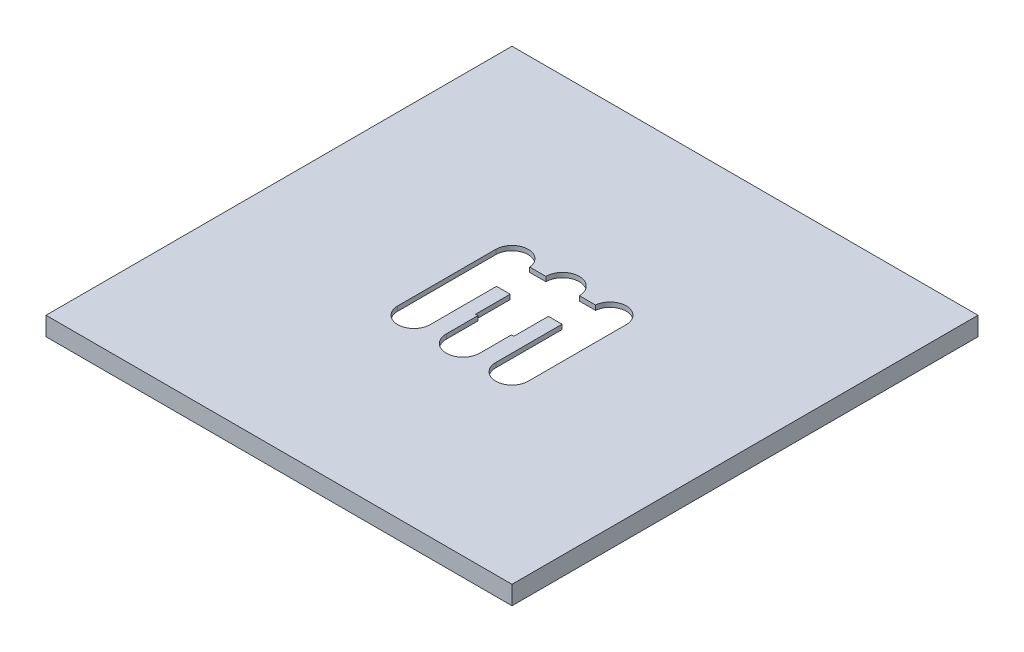
ISO-10303-21;
HEADER;
FILE_DESCRIPTION(('STEP AP214'),'2;1');
FILE_NAME('part.step','',(''),(''),'','','');
FILE_SCHEMA(('AUTOMOTIVE_DESIGN { 1 0 10303 214 1 1 1 1 }'));
ENDSEC;
DATA;
#1=APPLICATION_CONTEXT('core data for automotive mechanical design processes');
#2=APPLICATION_PROTOCOL_DEFINITION('international standard','automotive_design',2000,#1);
#3=PRODUCT_CONTEXT('',#1,'mechanical');
#4=PRODUCT('Part','Part','',(#3));
#5=PRODUCT_RELATED_PRODUCT_CATEGORY('part','',(#4));
#6=PRODUCT_DEFINITION_FORMATION('','',#4);
#7=PRODUCT_DEFINITION_CONTEXT('part definition',#1,'design');
#8=PRODUCT_DEFINITION('design','',#6,#7);
#9=PRODUCT_DEFINITION_SHAPE('','',#8);
#10=(LENGTH_UNIT() NAMED_UNIT(*) SI_UNIT(.MILLI.,.METRE.));
#11=(NAMED_UNIT(*) PLANE_ANGLE_UNIT() SI_UNIT($,.RADIAN.));
#12=(NAMED_UNIT(*) SI_UNIT($,.STERADIAN.) SOLID_ANGLE_UNIT());
#13=UNCERTAINTY_MEASURE_WITH_UNIT(LENGTH_MEASURE(1.E-05),#10,'distance_accuracy_value','');
#14=(GEOMETRIC_REPRESENTATION_CONTEXT(3) GLOBAL_UNCERTAINTY_ASSIGNED_CONTEXT((#13)) GLOBAL_UNIT_ASSIGNED_CONTEXT((#10,
#11,#12)) REPRESENTATION_CONTEXT('',''));
#15=CARTESIAN_POINT('',(0.,0.,0.));
#16=DIRECTION('',(0.,0.,1.));
#17=DIRECTION('',(1.,0.,0.));
#18=AXIS2_PLACEMENT_3D('',#15,#16,#17);
#19=CARTESIAN_POINT('',(0.,4.,0.));
#20=DIRECTION('',(0.,1.,0.));
#21=DIRECTION('',(0.,0.,1.));
#22=AXIS2_PLACEMENT_3D('',#19,#20,#21);
#23=PLANE('',#22);
#24=DIRECTION('',(0.,0.,1.));
#25=VECTOR('',#24,1.);
#26=CARTESIAN_POINT('',(-50.,4.,-50.));
#27=LINE('',#26,#25);
#28=CARTESIAN_POINT('',(-50.,4.,-50.));
#29=VERTEX_POINT('',#28);
#30=CARTESIAN_POINT('',(-50.,4.,50.));
#31=VERTEX_POINT('',#30);
#32=EDGE_CURVE('E394',#29,#31,#27,.T.);
#33=ORIENTED_EDGE('',*,*,#32,.T.);
#34=DIRECTION('',(1.,0.,0.));
#35=VECTOR('',#34,1.);
#36=CARTESIAN_POINT('',(-50.,4.,50.));
#37=LINE('',#36,#35);
#38=CARTESIAN_POINT('',(50.,4.,50.));
#39=VERTEX_POINT('',#38);
#40=EDGE_CURVE('E451',#31,#39,#37,.T.);
#41=ORIENTED_EDGE('',*,*,#40,.T.);
#42=DIRECTION('',(0.,0.,-1.));
#43=VECTOR('',#42,1.);
#44=CARTESIAN_POINT('',(50.,4.,50.));
#45=LINE('',#44,#43);
#46=CARTESIAN_POINT('',(50.,4.,-50.));
#47=VERTEX_POINT('',#46);
#48=EDGE_CURVE('E455',#39,#47,#45,.T.);
#49=ORIENTED_EDGE('',*,*,#48,.T.);
#50=DIRECTION('',(-1.,0.,0.));
#51=VECTOR('',#50,1.);
#52=CARTESIAN_POINT('',(50.,4.,-50.));
#53=LINE('',#52,#51);
#54=EDGE_CURVE('E459',#47,#29,#53,.T.);
#55=ORIENTED_EDGE('',*,*,#54,.T.);
#56=EDGE_LOOP('',(#33,#41,#49,#55));
#57=FACE_BOUND('',#56,.T.);
#58=DIRECTION('',(0.,0.,-1.));
#59=VECTOR('',#58,1.);
#60=CARTESIAN_POINT('',(-4.10477687296407,4.,0.));
#61=LINE('',#60,#59);
#62=CARTESIAN_POINT('',(-4.10477687296407,4.,3.70910488253883));
#63=VERTEX_POINT('',#62);
#64=CARTESIAN_POINT('',(-4.10477687296407,4.,-3.70910488253884));
#65=VERTEX_POINT('',#64);
#66=EDGE_CURVE('E247',#63,#65,#61,.T.);
#67=ORIENTED_EDGE('',*,*,#66,.T.);
#68=DIRECTION('',(1.,0.,0.));
#69=VECTOR('',#68,1.);
#70=CARTESIAN_POINT('',(0.,4.,-3.70910488253884));
#71=LINE('',#70,#69);
#72=CARTESIAN_POINT('',(-7.03476982904009,4.,-3.70910488253884));
#73=VERTEX_POINT('',#72);
#74=EDGE_CURVE('E238',#73,#65,#71,.T.);
#75=ORIENTED_EDGE('',*,*,#74,.F.);
#76=DIRECTION('',(0.,0.,-1.));
#77=VECTOR('',#76,1.);
#78=CARTESIAN_POINT('',(-7.0347698290401,4.,0.));
#79=LINE('',#78,#77);
#80=CARTESIAN_POINT('',(-7.0347698290401,4.,10.5173849145201));
#81=VERTEX_POINT('',#80);
#82=EDGE_CURVE('E228',#81,#73,#79,.T.);
#83=ORIENTED_EDGE('',*,*,#82,.F.);
#84=CARTESIAN_POINT('',(-10.5173849145201,4.,10.5173849145201));
#85=DIRECTION('',(0.,-1.,0.));
#86=DIRECTION('',(0.,0.,-1.));
#87=AXIS2_PLACEMENT_3D('',#84,#85,#86);
#88=CIRCLE('',#87,3.48261508547995);
#89=CARTESIAN_POINT('',(-14.,4.,10.5173849145201));
#90=VERTEX_POINT('',#89);
#91=EDGE_CURVE('E67',#81,#90,#88,.T.);
#92=ORIENTED_EDGE('',*,*,#91,.T.);
#93=DIRECTION('',(0.,0.,-1.));
#94=VECTOR('',#93,1.);
#95=CARTESIAN_POINT('',(-14.,4.,0.));
#96=LINE('',#95,#94);
#97=CARTESIAN_POINT('',(-14.,4.,-10.51738491452));
#98=VERTEX_POINT('',#97);
#99=EDGE_CURVE('E261',#90,#98,#96,.T.);
#100=ORIENTED_EDGE('',*,*,#99,.T.);
#101=CARTESIAN_POINT('',(-10.51738491452,4.,-10.51738491452));
#102=DIRECTION('',(0.,-1.,0.));
#103=DIRECTION('',(0.,0.,-1.));
#104=AXIS2_PLACEMENT_3D('',#101,#102,#103);
#105=CIRCLE('',#104,3.48261508547995);
#106=CARTESIAN_POINT('',(-7.05140271388099,4.,-10.8573484691341));
#107=VERTEX_POINT('',#106);
#108=EDGE_CURVE('E265',#98,#107,#105,.T.);
#109=ORIENTED_EDGE('',*,*,#108,.T.);
#110=DIRECTION('',(1.,0.,0.));
#111=VECTOR('',#110,1.);
#112=CARTESIAN_POINT('',(0.,4.,-10.8573484691341));
#113=LINE('',#112,#111);
#114=CARTESIAN_POINT('',(-3.5915745067874,4.,-10.8573484691341));
#115=VERTEX_POINT('',#114);
#116=EDGE_CURVE('E269',#107,#115,#113,.T.);
#117=ORIENTED_EDGE('',*,*,#116,.T.);
#118=CARTESIAN_POINT('',(0.,4.,-10.8573484691341));
#119=DIRECTION('',(0.,-1.,0.));
#120=DIRECTION('',(0.,0.,-1.));
#121=AXIS2_PLACEMENT_3D('',#118,#119,#120);
#122=CIRCLE('',#121,3.5915745067874);
#123=CARTESIAN_POINT('',(3.5915745067874,4.,-10.8573484691341));
#124=VERTEX_POINT('',#123);
#125=EDGE_CURVE('E273',#115,#124,#122,.T.);
#126=ORIENTED_EDGE('',*,*,#125,.T.);
#127=DIRECTION('',(1.,0.,0.));
#128=VECTOR('',#127,1.);
#129=CARTESIAN_POINT('',(0.,4.,-10.8573484691341));
#130=LINE('',#129,#128);
#131=CARTESIAN_POINT('',(7.05140271388099,4.,-10.8573484691341));
#132=VERTEX_POINT('',#131);
#133=EDGE_CURVE('E277',#124,#132,#130,.T.);
#134=ORIENTED_EDGE('',*,*,#133,.T.);
#135=CARTESIAN_POINT('',(10.51738491452,4.,-10.51738491452));
#136=DIRECTION('',(0.,-1.,0.));
#137=DIRECTION('',(0.,0.,-1.));
#138=AXIS2_PLACEMENT_3D('',#135,#136,#137);
#139=CIRCLE('',#138,3.48261508547995);
#140=CARTESIAN_POINT('',(14.,4.,-10.51738491452));
#141=VERTEX_POINT('',#140);
#142=EDGE_CURVE('E281',#141,#132,#139,.F.);
#143=ORIENTED_EDGE('',*,*,#142,.F.);
#144=DIRECTION('',(0.,0.,-1.));
#145=VECTOR('',#144,1.);
#146=CARTESIAN_POINT('',(14.,4.,0.));
#147=LINE('',#146,#145);
#148=CARTESIAN_POINT('',(14.,4.,10.5173849145201));
#149=VERTEX_POINT('',#148);
#150=EDGE_CURVE('E284',#149,#141,#147,.T.);
#151=ORIENTED_EDGE('',*,*,#150,.F.);
#152=CARTESIAN_POINT('',(10.5173849145201,4.,10.5173849145201));
#153=DIRECTION('',(0.,-1.,0.));
#154=DIRECTION('',(0.,0.,-1.));
#155=AXIS2_PLACEMENT_3D('',#152,#153,#154);
#156=CIRCLE('',#155,3.48261508547995);
#157=CARTESIAN_POINT('',(7.0347698290401,4.,10.5173849145201));
#158=VERTEX_POINT('',#157);
#159=EDGE_CURVE('E287',#158,#149,#156,.F.);
#160=ORIENTED_EDGE('',*,*,#159,.F.);
#161=DIRECTION('',(0.,0.,-1.));
#162=VECTOR('',#161,1.);
#163=CARTESIAN_POINT('',(7.0347698290401,4.,0.));
#164=LINE('',#163,#162);
#165=CARTESIAN_POINT('',(7.03476982904009,4.,-3.70910488253884));
#166=VERTEX_POINT('',#165);
#167=EDGE_CURVE('E290',#158,#166,#164,.T.);
#168=ORIENTED_EDGE('',*,*,#167,.T.);
#169=DIRECTION('',(1.,0.,0.));
#170=VECTOR('',#169,1.);
#171=CARTESIAN_POINT('',(0.,4.,-3.70910488253884));
#172=LINE('',#171,#170);
#173=CARTESIAN_POINT('',(4.10477687296407,4.,-3.70910488253884));
#174=VERTEX_POINT('',#173);
#175=EDGE_CURVE('E294',#174,#166,#172,.T.);
#176=ORIENTED_EDGE('',*,*,#175,.F.);
#177=DIRECTION('',(0.,0.,-1.));
#178=VECTOR('',#177,1.);
#179=CARTESIAN_POINT('',(4.10477687296407,4.,0.));
#180=LINE('',#179,#178);
#181=CARTESIAN_POINT('',(4.10477687296407,4.,3.70910488253883));
#182=VERTEX_POINT('',#181);
#183=EDGE_CURVE('E297',#182,#174,#180,.T.);
#184=ORIENTED_EDGE('',*,*,#183,.F.);
#185=DIRECTION('',(-1.,0.,0.));
#186=VECTOR('',#185,1.);
#187=CARTESIAN_POINT('',(0.,4.,3.70910488253883));
#188=LINE('',#187,#186);
#189=CARTESIAN_POINT('',(3.5915745067874,4.,3.70910488253883));
#190=VERTEX_POINT('',#189);
#191=EDGE_CURVE('E300',#182,#190,#188,.T.);
#192=ORIENTED_EDGE('',*,*,#191,.T.);
#193=DIRECTION('',(0.,0.,-1.));
#194=VECTOR('',#193,1.);
#195=CARTESIAN_POINT('',(3.5915745067874,4.,0.));
#196=LINE('',#195,#194);
#197=CARTESIAN_POINT('',(3.5915745067874,4.,10.51738491452));
#198=VERTEX_POINT('',#197);
#199=EDGE_CURVE('E304',#198,#190,#196,.T.);
#200=ORIENTED_EDGE('',*,*,#199,.F.);
#201=CARTESIAN_POINT('',(0.,4.,10.51738491452));
#202=DIRECTION('',(0.,-1.,0.));
#203=DIRECTION('',(0.,0.,-1.));
#204=AXIS2_PLACEMENT_3D('',#201,#202,#203);
#205=CIRCLE('',#204,3.5915745067874);
#206=CARTESIAN_POINT('',(-3.5915745067874,4.,10.51738491452));
#207=VERTEX_POINT('',#206);
#208=EDGE_CURVE('E307',#198,#207,#205,.T.);
#209=ORIENTED_EDGE('',*,*,#208,.T.);
#210=DIRECTION('',(0.,0.,-1.));
#211=VECTOR('',#210,1.);
#212=CARTESIAN_POINT('',(-3.5915745067874,4.,0.));
#213=LINE('',#212,#211);
#214=CARTESIAN_POINT('',(-3.5915745067874,4.,3.70910488253883));
#215=VERTEX_POINT('',#214);
#216=EDGE_CURVE('E311',#207,#215,#213,.T.);
#217=ORIENTED_EDGE('',*,*,#216,.T.);
#218=DIRECTION('',(-1.,0.,0.));
#219=VECTOR('',#218,1.);
#220=CARTESIAN_POINT('',(0.,4.,3.70910488253883));
#221=LINE('',#220,#219);
#222=EDGE_CURVE('E315',#215,#63,#221,.T.);
#223=ORIENTED_EDGE('',*,*,#222,.T.);
#224=EDGE_LOOP('',(#67,#75,#83,#92,#100,#109,#117,#126,#134,#143,#151,#160,#168,#176,#184,#192,
#200,#209,#217,#223));
#225=FACE_BOUND('',#224,.T.);
#226=ADVANCED_FACE('F43',(#57,#225),#23,.T.);
#227=CARTESIAN_POINT('',(0.,0.,0.));
#228=DIRECTION('',(0.,-1.,0.));
#229=DIRECTION('',(0.,0.,-1.));
#230=AXIS2_PLACEMENT_3D('',#227,#228,#229);
#231=PLANE('',#230);
#232=DIRECTION('',(0.,0.,1.));
#233=VECTOR('',#232,1.);
#234=CARTESIAN_POINT('',(-50.,0.,-50.));
#235=LINE('',#234,#233);
#236=CARTESIAN_POINT('',(-50.,0.,-50.));
#237=VERTEX_POINT('',#236);
#238=CARTESIAN_POINT('',(-50.,0.,50.));
#239=VERTEX_POINT('',#238);
#240=EDGE_CURVE('E509',#237,#239,#235,.T.);
#241=ORIENTED_EDGE('',*,*,#240,.F.);
#242=DIRECTION('',(-1.,0.,0.));
#243=VECTOR('',#242,1.);
#244=CARTESIAN_POINT('',(50.,0.,-50.));
#245=LINE('',#244,#243);
#246=CARTESIAN_POINT('',(50.,0.,-50.));
#247=VERTEX_POINT('',#246);
#248=EDGE_CURVE('E519',#247,#237,#245,.T.);
#249=ORIENTED_EDGE('',*,*,#248,.F.);
#250=DIRECTION('',(0.,0.,-1.));
#251=VECTOR('',#250,1.);
#252=CARTESIAN_POINT('',(50.,0.,-50.));
#253=LINE('',#252,#251);
#254=CARTESIAN_POINT('',(50.,0.,50.));
#255=VERTEX_POINT('',#254);
#256=EDGE_CURVE('E516',#255,#247,#253,.T.);
#257=ORIENTED_EDGE('',*,*,#256,.F.);
#258=DIRECTION('',(1.,0.,0.));
#259=VECTOR('',#258,1.);
#260=CARTESIAN_POINT('',(50.,0.,50.));
#261=LINE('',#260,#259);
#262=EDGE_CURVE('E513',#239,#255,#261,.T.);
#263=ORIENTED_EDGE('',*,*,#262,.F.);
#264=EDGE_LOOP('',(#241,#249,#257,#263));
#265=FACE_BOUND('',#264,.T.);
#266=DIRECTION('',(0.,0.,-1.));
#267=VECTOR('',#266,1.);
#268=CARTESIAN_POINT('',(48.,0.,-48.));
#269=LINE('',#268,#267);
#270=CARTESIAN_POINT('',(48.,0.,48.));
#271=VERTEX_POINT('',#270);
#272=CARTESIAN_POINT('',(48.,0.,-48.));
#273=VERTEX_POINT('',#272);
#274=EDGE_CURVE('E469',#271,#273,#269,.T.);
#275=ORIENTED_EDGE('',*,*,#274,.T.);
#276=DIRECTION('',(-1.,0.,0.));
#277=VECTOR('',#276,1.);
#278=CARTESIAN_POINT('',(48.,0.,-48.));
#279=LINE('',#278,#277);
#280=CARTESIAN_POINT('',(-48.,0.,-48.));
#281=VERTEX_POINT('',#280);
#282=EDGE_CURVE('E463',#273,#281,#279,.T.);
#283=ORIENTED_EDGE('',*,*,#282,.T.);
#284=DIRECTION('',(0.,0.,1.));
#285=VECTOR('',#284,1.);
#286=CARTESIAN_POINT('',(-48.,0.,-48.));
#287=LINE('',#286,#285);
#288=CARTESIAN_POINT('',(-48.,0.,48.));
#289=VERTEX_POINT('',#288);
#290=EDGE_CURVE('E485',#281,#289,#287,.T.);
#291=ORIENTED_EDGE('',*,*,#290,.T.);
#292=DIRECTION('',(1.,0.,0.));
#293=VECTOR('',#292,1.);
#294=CARTESIAN_POINT('',(48.,0.,48.));
#295=LINE('',#294,#293);
#296=EDGE_CURVE('E489',#289,#271,#295,.T.);
#297=ORIENTED_EDGE('',*,*,#296,.T.);
#298=EDGE_LOOP('',(#275,#283,#291,#297));
#299=FACE_BOUND('',#298,.T.);
#300=ADVANCED_FACE('F540',(#265,#299),#231,.T.);
#301=CARTESIAN_POINT('',(-50.,3.,-50.));
#302=DIRECTION('',(1.,0.,0.));
#303=DIRECTION('',(0.,0.,-1.));
#304=AXIS2_PLACEMENT_3D('',#301,#302,#303);
#305=PLANE('',#304);
#306=ORIENTED_EDGE('',*,*,#240,.T.);
#307=DIRECTION('',(0.,-1.,0.));
#308=VECTOR('',#307,1.);
#309=CARTESIAN_POINT('',(-50.,3.,50.));
#310=LINE('',#309,#308);
#311=EDGE_CURVE('E11',#31,#239,#310,.T.);
#312=ORIENTED_EDGE('',*,*,#311,.F.);
#313=ORIENTED_EDGE('',*,*,#32,.F.);
#314=DIRECTION('',(0.,-1.,0.));
#315=VECTOR('',#314,1.);
#316=CARTESIAN_POINT('',(-50.,3.,-50.));
#317=LINE('',#316,#315);
#318=EDGE_CURVE('E522',#29,#237,#317,.T.);
#319=ORIENTED_EDGE('',*,*,#318,.T.);
#320=EDGE_LOOP('',(#306,#312,#313,#319));
#321=FACE_BOUND('',#320,.T.);
#322=ADVANCED_FACE('F45',(#321),#305,.F.);
#323=CARTESIAN_POINT('',(50.,3.,50.));
#324=DIRECTION('',(0.,0.,-1.));
#325=DIRECTION('',(-1.,0.,0.));
#326=AXIS2_PLACEMENT_3D('',#323,#324,#325);
#327=PLANE('',#326);
#328=ORIENTED_EDGE('',*,*,#262,.T.);
#329=DIRECTION('',(0.,-1.,0.));
#330=VECTOR('',#329,1.);
#331=CARTESIAN_POINT('',(50.,3.,50.));
#332=LINE('',#331,#330);
#333=EDGE_CURVE('E52',#39,#255,#332,.T.);
#334=ORIENTED_EDGE('',*,*,#333,.F.);
#335=ORIENTED_EDGE('',*,*,#40,.F.);
#336=ORIENTED_EDGE('',*,*,#311,.T.);
#337=EDGE_LOOP('',(#328,#334,#335,#336));
#338=FACE_BOUND('',#337,.T.);
#339=ADVANCED_FACE('F548',(#338),#327,.F.);
#340=CARTESIAN_POINT('',(50.,3.,-50.));
#341=DIRECTION('',(-1.,0.,0.));
#342=DIRECTION('',(0.,0.,1.));
#343=AXIS2_PLACEMENT_3D('',#340,#341,#342);
#344=PLANE('',#343);
#345=ORIENTED_EDGE('',*,*,#256,.T.);
#346=DIRECTION('',(0.,-1.,0.));
#347=VECTOR('',#346,1.);
#348=CARTESIAN_POINT('',(50.,3.,-50.));
#349=LINE('',#348,#347);
#350=EDGE_CURVE('E526',#47,#247,#349,.T.);
#351=ORIENTED_EDGE('',*,*,#350,.F.);
#352=ORIENTED_EDGE('',*,*,#48,.F.);
#353=ORIENTED_EDGE('',*,*,#333,.T.);
#354=EDGE_LOOP('',(#345,#351,#352,#353));
#355=FACE_BOUND('',#354,.T.);
#356=ADVANCED_FACE('F534',(#355),#344,.F.);
#357=CARTESIAN_POINT('',(50.,3.,-50.));
#358=DIRECTION('',(0.,0.,1.));
#359=DIRECTION('',(1.,0.,0.));
#360=AXIS2_PLACEMENT_3D('',#357,#358,#359);
#361=PLANE('',#360);
#362=ORIENTED_EDGE('',*,*,#248,.T.);
#363=ORIENTED_EDGE('',*,*,#318,.F.);
#364=ORIENTED_EDGE('',*,*,#54,.F.);
#365=ORIENTED_EDGE('',*,*,#350,.T.);
#366=EDGE_LOOP('',(#362,#363,#364,#365));
#367=FACE_BOUND('',#366,.T.);
#368=ADVANCED_FACE('F543',(#367),#361,.F.);
#369=CARTESIAN_POINT('',(48.,3.,-48.));
#370=DIRECTION('',(0.,0.,1.));
#371=DIRECTION('',(1.,0.,0.));
#372=AXIS2_PLACEMENT_3D('',#369,#370,#371);
#373=PLANE('',#372);
#374=ORIENTED_EDGE('',*,*,#282,.F.);
#375=DIRECTION('',(0.,-1.,0.));
#376=VECTOR('',#375,1.);
#377=CARTESIAN_POINT('',(48.,3.,-48.));
#378=LINE('',#377,#376);
#379=CARTESIAN_POINT('',(48.,3.,-48.));
#380=VERTEX_POINT('',#379);
#381=EDGE_CURVE('E481',#380,#273,#378,.T.);
#382=ORIENTED_EDGE('',*,*,#381,.F.);
#383=DIRECTION('',(-1.,0.,0.));
#384=VECTOR('',#383,1.);
#385=CARTESIAN_POINT('',(48.,3.,-48.));
#386=LINE('',#385,#384);
#387=CARTESIAN_POINT('',(-48.,3.,-48.));
#388=VERTEX_POINT('',#387);
#389=EDGE_CURVE('E464',#380,#388,#386,.T.);
#390=ORIENTED_EDGE('',*,*,#389,.T.);
#391=DIRECTION('',(0.,-1.,0.));
#392=VECTOR('',#391,1.);
#393=CARTESIAN_POINT('',(-48.,3.,-48.));
#394=LINE('',#393,#392);
#395=EDGE_CURVE('E505',#388,#281,#394,.T.);
#396=ORIENTED_EDGE('',*,*,#395,.T.);
#397=EDGE_LOOP('',(#374,#382,#390,#396));
#398=FACE_BOUND('',#397,.T.);
#399=ADVANCED_FACE('F579',(#398),#373,.T.);
#400=CARTESIAN_POINT('',(-48.,3.,-48.));
#401=DIRECTION('',(1.,0.,0.));
#402=DIRECTION('',(0.,0.,-1.));
#403=AXIS2_PLACEMENT_3D('',#400,#401,#402);
#404=PLANE('',#403);
#405=ORIENTED_EDGE('',*,*,#290,.F.);
#406=ORIENTED_EDGE('',*,*,#395,.F.);
#407=DIRECTION('',(0.,0.,1.));
#408=VECTOR('',#407,1.);
#409=CARTESIAN_POINT('',(-48.,3.,-48.));
#410=LINE('',#409,#408);
#411=CARTESIAN_POINT('',(-48.,3.,48.));
#412=VERTEX_POINT('',#411);
#413=EDGE_CURVE('E468',#388,#412,#410,.T.);
#414=ORIENTED_EDGE('',*,*,#413,.T.);
#415=DIRECTION('',(0.,-1.,0.));
#416=VECTOR('',#415,1.);
#417=CARTESIAN_POINT('',(-48.,3.,48.));
#418=LINE('',#417,#416);
#419=EDGE_CURVE('E502',#412,#289,#418,.T.);
#420=ORIENTED_EDGE('',*,*,#419,.T.);
#421=EDGE_LOOP('',(#405,#406,#414,#420));
#422=FACE_BOUND('',#421,.T.);
#423=ADVANCED_FACE('F575',(#422),#404,.T.);
#424=CARTESIAN_POINT('',(48.,3.,48.));
#425=DIRECTION('',(0.,0.,-1.));
#426=DIRECTION('',(-1.,0.,0.));
#427=AXIS2_PLACEMENT_3D('',#424,#425,#426);
#428=PLANE('',#427);
#429=ORIENTED_EDGE('',*,*,#296,.F.);
#430=ORIENTED_EDGE('',*,*,#419,.F.);
#431=DIRECTION('',(1.,0.,0.));
#432=VECTOR('',#431,1.);
#433=CARTESIAN_POINT('',(48.,3.,48.));
#434=LINE('',#433,#432);
#435=CARTESIAN_POINT('',(48.,3.,48.));
#436=VERTEX_POINT('',#435);
#437=EDGE_CURVE('E473',#412,#436,#434,.T.);
#438=ORIENTED_EDGE('',*,*,#437,.T.);
#439=DIRECTION('',(0.,-1.,0.));
#440=VECTOR('',#439,1.);
#441=CARTESIAN_POINT('',(48.,3.,48.));
#442=LINE('',#441,#440);
#443=EDGE_CURVE('E499',#436,#271,#442,.T.);
#444=ORIENTED_EDGE('',*,*,#443,.T.);
#445=EDGE_LOOP('',(#429,#430,#438,#444));
#446=FACE_BOUND('',#445,.T.);
#447=ADVANCED_FACE('F571',(#446),#428,.T.);
#448=CARTESIAN_POINT('',(48.,3.,-48.));
#449=DIRECTION('',(-1.,0.,0.));
#450=DIRECTION('',(0.,0.,1.));
#451=AXIS2_PLACEMENT_3D('',#448,#449,#450);
#452=PLANE('',#451);
#453=ORIENTED_EDGE('',*,*,#274,.F.);
#454=ORIENTED_EDGE('',*,*,#443,.F.);
#455=DIRECTION('',(0.,0.,-1.));
#456=VECTOR('',#455,1.);
#457=CARTESIAN_POINT('',(48.,3.,-48.));
#458=LINE('',#457,#456);
#459=EDGE_CURVE('E477',#436,#380,#458,.T.);
#460=ORIENTED_EDGE('',*,*,#459,.T.);
#461=ORIENTED_EDGE('',*,*,#381,.T.);
#462=EDGE_LOOP('',(#453,#454,#460,#461));
#463=FACE_BOUND('',#462,.T.);
#464=ADVANCED_FACE('F567',(#463),#452,.T.);
#465=CARTESIAN_POINT('',(0.,3.,0.));
#466=DIRECTION('',(0.,1.,0.));
#467=DIRECTION('',(0.,0.,1.));
#468=AXIS2_PLACEMENT_3D('',#465,#466,#467);
#469=PLANE('',#468);
#470=DIRECTION('',(0.,0.,-1.));
#471=VECTOR('',#470,1.);
#472=CARTESIAN_POINT('',(-7.0347698290401,3.,0.));
#473=LINE('',#472,#471);
#474=CARTESIAN_POINT('',(-7.0347698290401,3.,10.5173849145201));
#475=VERTEX_POINT('',#474);
#476=CARTESIAN_POINT('',(-7.03476982904009,3.,-3.70910488253884));
#477=VERTEX_POINT('',#476);
#478=EDGE_CURVE('E322',#475,#477,#473,.T.);
#479=ORIENTED_EDGE('',*,*,#478,.T.);
#480=DIRECTION('',(1.,0.,0.));
#481=VECTOR('',#480,1.);
#482=CARTESIAN_POINT('',(0.,3.,-3.70910488253884));
#483=LINE('',#482,#481);
#484=CARTESIAN_POINT('',(-4.10477687296407,3.,-3.70910488253884));
#485=VERTEX_POINT('',#484);
#486=EDGE_CURVE('E244',#477,#485,#483,.T.);
#487=ORIENTED_EDGE('',*,*,#486,.T.);
#488=DIRECTION('',(0.,0.,-1.));
#489=VECTOR('',#488,1.);
#490=CARTESIAN_POINT('',(-4.10477687296407,3.,0.));
#491=LINE('',#490,#489);
#492=CARTESIAN_POINT('',(-4.10477687296407,3.,3.70910488253883));
#493=VERTEX_POINT('',#492);
#494=EDGE_CURVE('E253',#493,#485,#491,.T.);
#495=ORIENTED_EDGE('',*,*,#494,.F.);
#496=DIRECTION('',(-1.,0.,0.));
#497=VECTOR('',#496,1.);
#498=CARTESIAN_POINT('',(0.,3.,3.70910488253883));
#499=LINE('',#498,#497);
#500=CARTESIAN_POINT('',(-3.5915745067874,3.,3.70910488253883));
#501=VERTEX_POINT('',#500);
#502=EDGE_CURVE('E59',#501,#493,#499,.T.);
#503=ORIENTED_EDGE('',*,*,#502,.F.);
#504=DIRECTION('',(0.,0.,-1.));
#505=VECTOR('',#504,1.);
#506=CARTESIAN_POINT('',(-3.5915745067874,3.,0.));
#507=LINE('',#506,#505);
#508=CARTESIAN_POINT('',(-3.5915745067874,3.,10.51738491452));
#509=VERTEX_POINT('',#508);
#510=EDGE_CURVE('E385',#509,#501,#507,.T.);
#511=ORIENTED_EDGE('',*,*,#510,.F.);
#512=CARTESIAN_POINT('',(0.,3.,10.51738491452));
#513=DIRECTION('',(0.,-1.,0.));
#514=DIRECTION('',(0.,0.,-1.));
#515=AXIS2_PLACEMENT_3D('',#512,#513,#514);
#516=CIRCLE('',#515,3.5915745067874);
#517=CARTESIAN_POINT('',(3.5915745067874,3.,10.51738491452));
#518=VERTEX_POINT('',#517);
#519=EDGE_CURVE('E381',#518,#509,#516,.T.);
#520=ORIENTED_EDGE('',*,*,#519,.F.);
#521=DIRECTION('',(0.,0.,-1.));
#522=VECTOR('',#521,1.);
#523=CARTESIAN_POINT('',(3.5915745067874,3.,0.));
#524=LINE('',#523,#522);
#525=CARTESIAN_POINT('',(3.5915745067874,3.,3.70910488253883));
#526=VERTEX_POINT('',#525);
#527=EDGE_CURVE('E377',#518,#526,#524,.T.);
#528=ORIENTED_EDGE('',*,*,#527,.T.);
#529=DIRECTION('',(-1.,0.,0.));
#530=VECTOR('',#529,1.);
#531=CARTESIAN_POINT('',(0.,3.,3.70910488253883));
#532=LINE('',#531,#530);
#533=CARTESIAN_POINT('',(4.10477687296407,3.,3.70910488253883));
#534=VERTEX_POINT('',#533);
#535=EDGE_CURVE('E373',#534,#526,#532,.T.);
#536=ORIENTED_EDGE('',*,*,#535,.F.);
#537=DIRECTION('',(0.,0.,-1.));
#538=VECTOR('',#537,1.);
#539=CARTESIAN_POINT('',(4.10477687296407,3.,0.));
#540=LINE('',#539,#538);
#541=CARTESIAN_POINT('',(4.10477687296407,3.,-3.70910488253884));
#542=VERTEX_POINT('',#541);
#543=EDGE_CURVE('E369',#534,#542,#540,.T.);
#544=ORIENTED_EDGE('',*,*,#543,.T.);
#545=DIRECTION('',(1.,0.,0.));
#546=VECTOR('',#545,1.);
#547=CARTESIAN_POINT('',(0.,3.,-3.70910488253884));
#548=LINE('',#547,#546);
#549=CARTESIAN_POINT('',(7.03476982904009,3.,-3.70910488253884));
#550=VERTEX_POINT('',#549);
#551=EDGE_CURVE('E365',#542,#550,#548,.T.);
#552=ORIENTED_EDGE('',*,*,#551,.T.);
#553=DIRECTION('',(0.,0.,-1.));
#554=VECTOR('',#553,1.);
#555=CARTESIAN_POINT('',(7.0347698290401,3.,0.));
#556=LINE('',#555,#554);
#557=CARTESIAN_POINT('',(7.0347698290401,3.,10.5173849145201));
#558=VERTEX_POINT('',#557);
#559=EDGE_CURVE('E361',#558,#550,#556,.T.);
#560=ORIENTED_EDGE('',*,*,#559,.F.);
#561=CARTESIAN_POINT('',(10.5173849145201,3.,10.5173849145201));
#562=DIRECTION('',(0.,-1.,0.));
#563=DIRECTION('',(0.,0.,-1.));
#564=AXIS2_PLACEMENT_3D('',#561,#562,#563);
#565=CIRCLE('',#564,3.48261508547995);
#566=CARTESIAN_POINT('',(14.,3.,10.5173849145201));
#567=VERTEX_POINT('',#566);
#568=EDGE_CURVE('E357',#558,#567,#565,.F.);
#569=ORIENTED_EDGE('',*,*,#568,.T.);
#570=DIRECTION('',(0.,0.,-1.));
#571=VECTOR('',#570,1.);
#572=CARTESIAN_POINT('',(14.,3.,0.));
#573=LINE('',#572,#571);
#574=CARTESIAN_POINT('',(14.,3.,-10.51738491452));
#575=VERTEX_POINT('',#574);
#576=EDGE_CURVE('E353',#567,#575,#573,.T.);
#577=ORIENTED_EDGE('',*,*,#576,.T.);
#578=CARTESIAN_POINT('',(10.51738491452,3.,-10.51738491452));
#579=DIRECTION('',(0.,-1.,0.));
#580=DIRECTION('',(0.,0.,-1.));
#581=AXIS2_PLACEMENT_3D('',#578,#579,#580);
#582=CIRCLE('',#581,3.48261508547995);
#583=CARTESIAN_POINT('',(7.05140271388099,3.,-10.8573484691341));
#584=VERTEX_POINT('',#583);
#585=EDGE_CURVE('E349',#575,#584,#582,.F.);
#586=ORIENTED_EDGE('',*,*,#585,.T.);
#587=DIRECTION('',(1.,0.,0.));
#588=VECTOR('',#587,1.);
#589=CARTESIAN_POINT('',(0.,3.,-10.8573484691341));
#590=LINE('',#589,#588);
#591=CARTESIAN_POINT('',(3.5915745067874,3.,-10.8573484691341));
#592=VERTEX_POINT('',#591);
#593=EDGE_CURVE('E345',#592,#584,#590,.T.);
#594=ORIENTED_EDGE('',*,*,#593,.F.);
#595=CARTESIAN_POINT('',(0.,3.,-10.8573484691341));
#596=DIRECTION('',(0.,-1.,0.));
#597=DIRECTION('',(0.,0.,-1.));
#598=AXIS2_PLACEMENT_3D('',#595,#596,#597);
#599=CIRCLE('',#598,3.5915745067874);
#600=CARTESIAN_POINT('',(-3.5915745067874,3.,-10.8573484691341));
#601=VERTEX_POINT('',#600);
#602=EDGE_CURVE('E341',#601,#592,#599,.T.);
#603=ORIENTED_EDGE('',*,*,#602,.F.);
#604=DIRECTION('',(1.,0.,0.));
#605=VECTOR('',#604,1.);
#606=CARTESIAN_POINT('',(0.,3.,-10.8573484691341));
#607=LINE('',#606,#605);
#608=CARTESIAN_POINT('',(-7.05140271388099,3.,-10.8573484691341));
#609=VERTEX_POINT('',#608);
#610=EDGE_CURVE('E337',#609,#601,#607,.T.);
#611=ORIENTED_EDGE('',*,*,#610,.F.);
#612=CARTESIAN_POINT('',(-10.51738491452,3.,-10.51738491452));
#613=DIRECTION('',(0.,-1.,0.));
#614=DIRECTION('',(0.,0.,-1.));
#615=AXIS2_PLACEMENT_3D('',#612,#613,#614);
#616=CIRCLE('',#615,3.48261508547995);
#617=CARTESIAN_POINT('',(-14.,3.,-10.51738491452));
#618=VERTEX_POINT('',#617);
#619=EDGE_CURVE('E333',#618,#609,#616,.T.);
#620=ORIENTED_EDGE('',*,*,#619,.F.);
#621=DIRECTION('',(0.,0.,-1.));
#622=VECTOR('',#621,1.);
#623=CARTESIAN_POINT('',(-14.,3.,0.));
#624=LINE('',#623,#622);
#625=CARTESIAN_POINT('',(-14.,3.,10.5173849145201));
#626=VERTEX_POINT('',#625);
#627=EDGE_CURVE('E329',#626,#618,#624,.T.);
#628=ORIENTED_EDGE('',*,*,#627,.F.);
#629=CARTESIAN_POINT('',(-10.5173849145201,3.,10.5173849145201));
#630=DIRECTION('',(0.,-1.,0.));
#631=DIRECTION('',(0.,0.,-1.));
#632=AXIS2_PLACEMENT_3D('',#629,#630,#631);
#633=CIRCLE('',#632,3.48261508547995);
#634=EDGE_CURVE('E325',#475,#626,#633,.T.);
#635=ORIENTED_EDGE('',*,*,#634,.F.);
#636=EDGE_LOOP('',(#479,#487,#495,#503,#511,#520,#528,#536,#544,#552,#560,#569,#577,#586,#594,
#603,#611,#620,#628,#635));
#637=FACE_BOUND('',#636,.T.);
#638=ORIENTED_EDGE('',*,*,#389,.F.);
#639=ORIENTED_EDGE('',*,*,#459,.F.);
#640=ORIENTED_EDGE('',*,*,#437,.F.);
#641=ORIENTED_EDGE('',*,*,#413,.F.);
#642=EDGE_LOOP('',(#638,#639,#640,#641));
#643=FACE_BOUND('',#642,.T.);
#644=ADVANCED_FACE('F564',(#637,#643),#469,.F.);
#645=CARTESIAN_POINT('',(0.,4.,-3.70910488253884));
#646=DIRECTION('',(0.,0.,-1.));
#647=DIRECTION('',(-1.,0.,0.));
#648=AXIS2_PLACEMENT_3D('',#645,#646,#647);
#649=PLANE('',#648);
#650=ORIENTED_EDGE('',*,*,#486,.F.);
#651=DIRECTION('',(0.,-1.,0.));
#652=VECTOR('',#651,1.);
#653=CARTESIAN_POINT('',(-7.03476982904009,4.,-3.70910488253884));
#654=LINE('',#653,#652);
#655=EDGE_CURVE('E232',#73,#477,#654,.T.);
#656=ORIENTED_EDGE('',*,*,#655,.F.);
#657=ORIENTED_EDGE('',*,*,#74,.T.);
#658=DIRECTION('',(0.,-1.,0.));
#659=VECTOR('',#658,1.);
#660=CARTESIAN_POINT('',(-4.10477687296407,4.,-3.70910488253884));
#661=LINE('',#660,#659);
#662=EDGE_CURVE('E391',#65,#485,#661,.T.);
#663=ORIENTED_EDGE('',*,*,#662,.T.);
#664=EDGE_LOOP('',(#650,#656,#657,#663));
#665=FACE_BOUND('',#664,.T.);
#666=ADVANCED_FACE('F241',(#665),#649,.T.);
#667=CARTESIAN_POINT('',(-4.10477687296407,4.,0.));
#668=DIRECTION('',(-1.,0.,0.));
#669=DIRECTION('',(0.,0.,1.));
#670=AXIS2_PLACEMENT_3D('',#667,#668,#669);
#671=PLANE('',#670);
#672=ORIENTED_EDGE('',*,*,#494,.T.);
#673=ORIENTED_EDGE('',*,*,#662,.F.);
#674=ORIENTED_EDGE('',*,*,#66,.F.);
#675=DIRECTION('',(0.,-1.,0.));
#676=VECTOR('',#675,1.);
#677=CARTESIAN_POINT('',(-4.10477687296407,4.,3.70910488253883));
#678=LINE('',#677,#676);
#679=EDGE_CURVE('E395',#63,#493,#678,.T.);
#680=ORIENTED_EDGE('',*,*,#679,.T.);
#681=EDGE_LOOP('',(#672,#673,#674,#680));
#682=FACE_BOUND('',#681,.T.);
#683=ADVANCED_FACE('F615',(#682),#671,.F.);
#684=CARTESIAN_POINT('',(0.,4.,3.70910488253883));
#685=DIRECTION('',(0.,0.,1.));
#686=DIRECTION('',(1.,0.,0.));
#687=AXIS2_PLACEMENT_3D('',#684,#685,#686);
#688=PLANE('',#687);
#689=ORIENTED_EDGE('',*,*,#502,.T.);
#690=ORIENTED_EDGE('',*,*,#679,.F.);
#691=ORIENTED_EDGE('',*,*,#222,.F.);
#692=DIRECTION('',(0.,-1.,0.));
#693=VECTOR('',#692,1.);
#694=CARTESIAN_POINT('',(-3.5915745067874,4.,3.70910488253883));
#695=LINE('',#694,#693);
#696=EDGE_CURVE('E398',#215,#501,#695,.T.);
#697=ORIENTED_EDGE('',*,*,#696,.T.);
#698=EDGE_LOOP('',(#689,#690,#691,#697));
#699=FACE_BOUND('',#698,.T.);
#700=ADVANCED_FACE('F621',(#699),#688,.F.);
#701=CARTESIAN_POINT('',(-3.5915745067874,4.,0.));
#702=DIRECTION('',(-1.,0.,0.));
#703=DIRECTION('',(0.,0.,1.));
#704=AXIS2_PLACEMENT_3D('',#701,#702,#703);
#705=PLANE('',#704);
#706=ORIENTED_EDGE('',*,*,#510,.T.);
#707=ORIENTED_EDGE('',*,*,#696,.F.);
#708=ORIENTED_EDGE('',*,*,#216,.F.);
#709=DIRECTION('',(0.,-1.,0.));
#710=VECTOR('',#709,1.);
#711=CARTESIAN_POINT('',(-3.5915745067874,4.,10.51738491452));
#712=LINE('',#711,#710);
#713=EDGE_CURVE('E401',#207,#509,#712,.T.);
#714=ORIENTED_EDGE('',*,*,#713,.T.);
#715=EDGE_LOOP('',(#706,#707,#708,#714));
#716=FACE_BOUND('',#715,.T.);
#717=ADVANCED_FACE('F629',(#716),#705,.F.);
#718=CARTESIAN_POINT('',(0.,4.,10.51738491452));
#719=DIRECTION('',(0.,-1.,0.));
#720=DIRECTION('',(0.,0.,-1.));
#721=AXIS2_PLACEMENT_3D('',#718,#719,#720);
#722=CYLINDRICAL_SURFACE('',#721,3.5915745067874);
#723=ORIENTED_EDGE('',*,*,#519,.T.);
#724=ORIENTED_EDGE('',*,*,#713,.F.);
#725=ORIENTED_EDGE('',*,*,#208,.F.);
#726=DIRECTION('',(0.,-1.,0.));
#727=VECTOR('',#726,1.);
#728=CARTESIAN_POINT('',(3.5915745067874,4.,10.51738491452));
#729=LINE('',#728,#727);
#730=EDGE_CURVE('E404',#198,#518,#729,.T.);
#731=ORIENTED_EDGE('',*,*,#730,.T.);
#732=EDGE_LOOP('',(#723,#724,#725,#731));
#733=FACE_BOUND('',#732,.T.);
#734=ADVANCED_FACE('F636',(#733),#722,.F.);
#735=CARTESIAN_POINT('',(3.5915745067874,4.,0.));
#736=DIRECTION('',(-1.,0.,0.));
#737=DIRECTION('',(0.,0.,1.));
#738=AXIS2_PLACEMENT_3D('',#735,#736,#737);
#739=PLANE('',#738);
#740=ORIENTED_EDGE('',*,*,#527,.F.);
#741=ORIENTED_EDGE('',*,*,#730,.F.);
#742=ORIENTED_EDGE('',*,*,#199,.T.);
#743=DIRECTION('',(0.,-1.,0.));
#744=VECTOR('',#743,1.);
#745=CARTESIAN_POINT('',(3.5915745067874,4.,3.70910488253883));
#746=LINE('',#745,#744);
#747=EDGE_CURVE('E407',#190,#526,#746,.T.);
#748=ORIENTED_EDGE('',*,*,#747,.T.);
#749=EDGE_LOOP('',(#740,#741,#742,#748));
#750=FACE_BOUND('',#749,.T.);
#751=ADVANCED_FACE('F644',(#750),#739,.T.);
#752=CARTESIAN_POINT('',(0.,4.,3.70910488253883));
#753=DIRECTION('',(0.,0.,1.));
#754=DIRECTION('',(1.,0.,0.));
#755=AXIS2_PLACEMENT_3D('',#752,#753,#754);
#756=PLANE('',#755);
#757=ORIENTED_EDGE('',*,*,#535,.T.);
#758=ORIENTED_EDGE('',*,*,#747,.F.);
#759=ORIENTED_EDGE('',*,*,#191,.F.);
#760=DIRECTION('',(0.,-1.,0.));
#761=VECTOR('',#760,1.);
#762=CARTESIAN_POINT('',(4.10477687296407,4.,3.70910488253883));
#763=LINE('',#762,#761);
#764=EDGE_CURVE('E410',#182,#534,#763,.T.);
#765=ORIENTED_EDGE('',*,*,#764,.T.);
#766=EDGE_LOOP('',(#757,#758,#759,#765));
#767=FACE_BOUND('',#766,.T.);
#768=ADVANCED_FACE('F652',(#767),#756,.F.);
#769=CARTESIAN_POINT('',(4.10477687296407,4.,0.));
#770=DIRECTION('',(-1.,0.,0.));
#771=DIRECTION('',(0.,0.,1.));
#772=AXIS2_PLACEMENT_3D('',#769,#770,#771);
#773=PLANE('',#772);
#774=ORIENTED_EDGE('',*,*,#543,.F.);
#775=ORIENTED_EDGE('',*,*,#764,.F.);
#776=ORIENTED_EDGE('',*,*,#183,.T.);
#777=DIRECTION('',(0.,-1.,0.));
#778=VECTOR('',#777,1.);
#779=CARTESIAN_POINT('',(4.10477687296407,4.,-3.70910488253884));
#780=LINE('',#779,#778);
#781=EDGE_CURVE('E413',#174,#542,#780,.T.);
#782=ORIENTED_EDGE('',*,*,#781,.T.);
#783=EDGE_LOOP('',(#774,#775,#776,#782));
#784=FACE_BOUND('',#783,.T.);
#785=ADVANCED_FACE('F660',(#784),#773,.T.);
#786=CARTESIAN_POINT('',(0.,4.,-3.70910488253884));
#787=DIRECTION('',(0.,0.,-1.));
#788=DIRECTION('',(-1.,0.,0.));
#789=AXIS2_PLACEMENT_3D('',#786,#787,#788);
#790=PLANE('',#789);
#791=ORIENTED_EDGE('',*,*,#551,.F.);
#792=ORIENTED_EDGE('',*,*,#781,.F.);
#793=ORIENTED_EDGE('',*,*,#175,.T.);
#794=DIRECTION('',(0.,-1.,0.));
#795=VECTOR('',#794,1.);
#796=CARTESIAN_POINT('',(7.03476982904009,4.,-3.70910488253884));
#797=LINE('',#796,#795);
#798=EDGE_CURVE('E416',#166,#550,#797,.T.);
#799=ORIENTED_EDGE('',*,*,#798,.T.);
#800=EDGE_LOOP('',(#791,#792,#793,#799));
#801=FACE_BOUND('',#800,.T.);
#802=ADVANCED_FACE('F668',(#801),#790,.T.);
#803=CARTESIAN_POINT('',(7.0347698290401,4.,0.));
#804=DIRECTION('',(-1.,0.,0.));
#805=DIRECTION('',(0.,0.,1.));
#806=AXIS2_PLACEMENT_3D('',#803,#804,#805);
#807=PLANE('',#806);
#808=ORIENTED_EDGE('',*,*,#559,.T.);
#809=ORIENTED_EDGE('',*,*,#798,.F.);
#810=ORIENTED_EDGE('',*,*,#167,.F.);
#811=DIRECTION('',(0.,-1.,0.));
#812=VECTOR('',#811,1.);
#813=CARTESIAN_POINT('',(7.0347698290401,4.,10.5173849145201));
#814=LINE('',#813,#812);
#815=EDGE_CURVE('E419',#158,#558,#814,.T.);
#816=ORIENTED_EDGE('',*,*,#815,.T.);
#817=EDGE_LOOP('',(#808,#809,#810,#816));
#818=FACE_BOUND('',#817,.T.);
#819=ADVANCED_FACE('F676',(#818),#807,.F.);
#820=CARTESIAN_POINT('',(10.5173849145201,4.,10.5173849145201));
#821=DIRECTION('',(0.,-1.,0.));
#822=DIRECTION('',(0.,0.,-1.));
#823=AXIS2_PLACEMENT_3D('',#820,#821,#822);
#824=CYLINDRICAL_SURFACE('',#823,3.48261508547995);
#825=ORIENTED_EDGE('',*,*,#568,.F.);
#826=ORIENTED_EDGE('',*,*,#815,.F.);
#827=ORIENTED_EDGE('',*,*,#159,.T.);
#828=DIRECTION('',(0.,-1.,0.));
#829=VECTOR('',#828,1.);
#830=CARTESIAN_POINT('',(14.,4.,10.5173849145201));
#831=LINE('',#830,#829);
#832=EDGE_CURVE('E422',#149,#567,#831,.T.);
#833=ORIENTED_EDGE('',*,*,#832,.T.);
#834=EDGE_LOOP('',(#825,#826,#827,#833));
#835=FACE_BOUND('',#834,.T.);
#836=ADVANCED_FACE('F684',(#835),#824,.F.);
#837=CARTESIAN_POINT('',(14.,4.,0.));
#838=DIRECTION('',(-1.,0.,0.));
#839=DIRECTION('',(0.,0.,1.));
#840=AXIS2_PLACEMENT_3D('',#837,#838,#839);
#841=PLANE('',#840);
#842=ORIENTED_EDGE('',*,*,#576,.F.);
#843=ORIENTED_EDGE('',*,*,#832,.F.);
#844=ORIENTED_EDGE('',*,*,#150,.T.);
#845=DIRECTION('',(0.,-1.,0.));
#846=VECTOR('',#845,1.);
#847=CARTESIAN_POINT('',(14.,4.,-10.51738491452));
#848=LINE('',#847,#846);
#849=EDGE_CURVE('E425',#141,#575,#848,.T.);
#850=ORIENTED_EDGE('',*,*,#849,.T.);
#851=EDGE_LOOP('',(#842,#843,#844,#850));
#852=FACE_BOUND('',#851,.T.);
#853=ADVANCED_FACE('F692',(#852),#841,.T.);
#854=CARTESIAN_POINT('',(10.51738491452,4.,-10.51738491452));
#855=DIRECTION('',(0.,-1.,0.));
#856=DIRECTION('',(0.,0.,-1.));
#857=AXIS2_PLACEMENT_3D('',#854,#855,#856);
#858=CYLINDRICAL_SURFACE('',#857,3.48261508547995);
#859=ORIENTED_EDGE('',*,*,#585,.F.);
#860=ORIENTED_EDGE('',*,*,#849,.F.);
#861=ORIENTED_EDGE('',*,*,#142,.T.);
#862=DIRECTION('',(0.,-1.,0.));
#863=VECTOR('',#862,1.);
#864=CARTESIAN_POINT('',(7.05140271388099,4.,-10.8573484691341));
#865=LINE('',#864,#863);
#866=EDGE_CURVE('E428',#132,#584,#865,.T.);
#867=ORIENTED_EDGE('',*,*,#866,.T.);
#868=EDGE_LOOP('',(#859,#860,#861,#867));
#869=FACE_BOUND('',#868,.T.);
#870=ADVANCED_FACE('F700',(#869),#858,.F.);
#871=CARTESIAN_POINT('',(0.,4.,-10.8573484691341));
#872=DIRECTION('',(0.,0.,-1.));
#873=DIRECTION('',(-1.,0.,0.));
#874=AXIS2_PLACEMENT_3D('',#871,#872,#873);
#875=PLANE('',#874);
#876=ORIENTED_EDGE('',*,*,#593,.T.);
#877=ORIENTED_EDGE('',*,*,#866,.F.);
#878=ORIENTED_EDGE('',*,*,#133,.F.);
#879=DIRECTION('',(0.,-1.,0.));
#880=VECTOR('',#879,1.);
#881=CARTESIAN_POINT('',(3.5915745067874,4.,-10.8573484691341));
#882=LINE('',#881,#880);
#883=EDGE_CURVE('E431',#124,#592,#882,.T.);
#884=ORIENTED_EDGE('',*,*,#883,.T.);
#885=EDGE_LOOP('',(#876,#877,#878,#884));
#886=FACE_BOUND('',#885,.T.);
#887=ADVANCED_FACE('F708',(#886),#875,.F.);
#888=CARTESIAN_POINT('',(0.,4.,-10.8573484691341));
#889=DIRECTION('',(0.,-1.,0.));
#890=DIRECTION('',(0.,0.,-1.));
#891=AXIS2_PLACEMENT_3D('',#888,#889,#890);
#892=CYLINDRICAL_SURFACE('',#891,3.5915745067874);
#893=ORIENTED_EDGE('',*,*,#602,.T.);
#894=ORIENTED_EDGE('',*,*,#883,.F.);
#895=ORIENTED_EDGE('',*,*,#125,.F.);
#896=DIRECTION('',(0.,-1.,0.));
#897=VECTOR('',#896,1.);
#898=CARTESIAN_POINT('',(-3.5915745067874,4.,-10.8573484691341));
#899=LINE('',#898,#897);
#900=EDGE_CURVE('E434',#115,#601,#899,.T.);
#901=ORIENTED_EDGE('',*,*,#900,.T.);
#902=EDGE_LOOP('',(#893,#894,#895,#901));
#903=FACE_BOUND('',#902,.T.);
#904=ADVANCED_FACE('F716',(#903),#892,.F.);
#905=CARTESIAN_POINT('',(0.,4.,-10.8573484691341));
#906=DIRECTION('',(0.,0.,-1.));
#907=DIRECTION('',(-1.,0.,0.));
#908=AXIS2_PLACEMENT_3D('',#905,#906,#907);
#909=PLANE('',#908);
#910=ORIENTED_EDGE('',*,*,#610,.T.);
#911=ORIENTED_EDGE('',*,*,#900,.F.);
#912=ORIENTED_EDGE('',*,*,#116,.F.);
#913=DIRECTION('',(0.,-1.,0.));
#914=VECTOR('',#913,1.);
#915=CARTESIAN_POINT('',(-7.05140271388099,4.,-10.8573484691341));
#916=LINE('',#915,#914);
#917=EDGE_CURVE('E437',#107,#609,#916,.T.);
#918=ORIENTED_EDGE('',*,*,#917,.T.);
#919=EDGE_LOOP('',(#910,#911,#912,#918));
#920=FACE_BOUND('',#919,.T.);
#921=ADVANCED_FACE('F724',(#920),#909,.F.);
#922=CARTESIAN_POINT('',(-10.51738491452,4.,-10.51738491452));
#923=DIRECTION('',(0.,-1.,0.));
#924=DIRECTION('',(0.,0.,-1.));
#925=AXIS2_PLACEMENT_3D('',#922,#923,#924);
#926=CYLINDRICAL_SURFACE('',#925,3.48261508547995);
#927=ORIENTED_EDGE('',*,*,#619,.T.);
#928=ORIENTED_EDGE('',*,*,#917,.F.);
#929=ORIENTED_EDGE('',*,*,#108,.F.);
#930=DIRECTION('',(0.,-1.,0.));
#931=VECTOR('',#930,1.);
#932=CARTESIAN_POINT('',(-14.,4.,-10.51738491452));
#933=LINE('',#932,#931);
#934=EDGE_CURVE('E440',#98,#618,#933,.T.);
#935=ORIENTED_EDGE('',*,*,#934,.T.);
#936=EDGE_LOOP('',(#927,#928,#929,#935));
#937=FACE_BOUND('',#936,.T.);
#938=ADVANCED_FACE('F732',(#937),#926,.F.);
#939=CARTESIAN_POINT('',(-14.,4.,0.));
#940=DIRECTION('',(-1.,0.,0.));
#941=DIRECTION('',(0.,0.,1.));
#942=AXIS2_PLACEMENT_3D('',#939,#940,#941);
#943=PLANE('',#942);
#944=ORIENTED_EDGE('',*,*,#627,.T.);
#945=ORIENTED_EDGE('',*,*,#934,.F.);
#946=ORIENTED_EDGE('',*,*,#99,.F.);
#947=DIRECTION('',(0.,-1.,0.));
#948=VECTOR('',#947,1.);
#949=CARTESIAN_POINT('',(-14.,4.,10.5173849145201));
#950=LINE('',#949,#948);
#951=EDGE_CURVE('E443',#90,#626,#950,.T.);
#952=ORIENTED_EDGE('',*,*,#951,.T.);
#953=EDGE_LOOP('',(#944,#945,#946,#952));
#954=FACE_BOUND('',#953,.T.);
#955=ADVANCED_FACE('F740',(#954),#943,.F.);
#956=CARTESIAN_POINT('',(-10.5173849145201,4.,10.5173849145201));
#957=DIRECTION('',(0.,-1.,0.));
#958=DIRECTION('',(0.,0.,-1.));
#959=AXIS2_PLACEMENT_3D('',#956,#957,#958);
#960=CYLINDRICAL_SURFACE('',#959,3.48261508547995);
#961=ORIENTED_EDGE('',*,*,#634,.T.);
#962=ORIENTED_EDGE('',*,*,#951,.F.);
#963=ORIENTED_EDGE('',*,*,#91,.F.);
#964=DIRECTION('',(0.,-1.,0.));
#965=VECTOR('',#964,1.);
#966=CARTESIAN_POINT('',(-7.0347698290401,4.,10.5173849145201));
#967=LINE('',#966,#965);
#968=EDGE_CURVE('E234',#81,#475,#967,.T.);
#969=ORIENTED_EDGE('',*,*,#968,.T.);
#970=EDGE_LOOP('',(#961,#962,#963,#969));
#971=FACE_BOUND('',#970,.T.);
#972=ADVANCED_FACE('F748',(#971),#960,.F.);
#973=CARTESIAN_POINT('',(-7.0347698290401,4.,0.));
#974=DIRECTION('',(-1.,0.,0.));
#975=DIRECTION('',(0.,0.,1.));
#976=AXIS2_PLACEMENT_3D('',#973,#974,#975);
#977=PLANE('',#976);
#978=ORIENTED_EDGE('',*,*,#478,.F.);
#979=ORIENTED_EDGE('',*,*,#968,.F.);
#980=ORIENTED_EDGE('',*,*,#82,.T.);
#981=ORIENTED_EDGE('',*,*,#655,.T.);
#982=EDGE_LOOP('',(#978,#979,#980,#981));
#983=FACE_BOUND('',#982,.T.);
#984=ADVANCED_FACE('F231',(#983),#977,.T.);
#985=CLOSED_SHELL('',(#226,#300,#322,#339,#356,#368,#399,#423,#447,#464,#644,#666,#683,#700,
#717,#734,#751,#768,#785,#802,#819,#836,#853,#870,#887,#904,#921,#938,#955,#972,#984));
#986=MANIFOLD_SOLID_BREP('B2',#985);
#987=ADVANCED_BREP_SHAPE_REPRESENTATION('',(#18,#986),#14);
#988=SHAPE_DEFINITION_REPRESENTATION(#9,#987);
ENDSEC;
END-ISO-10303-21;
